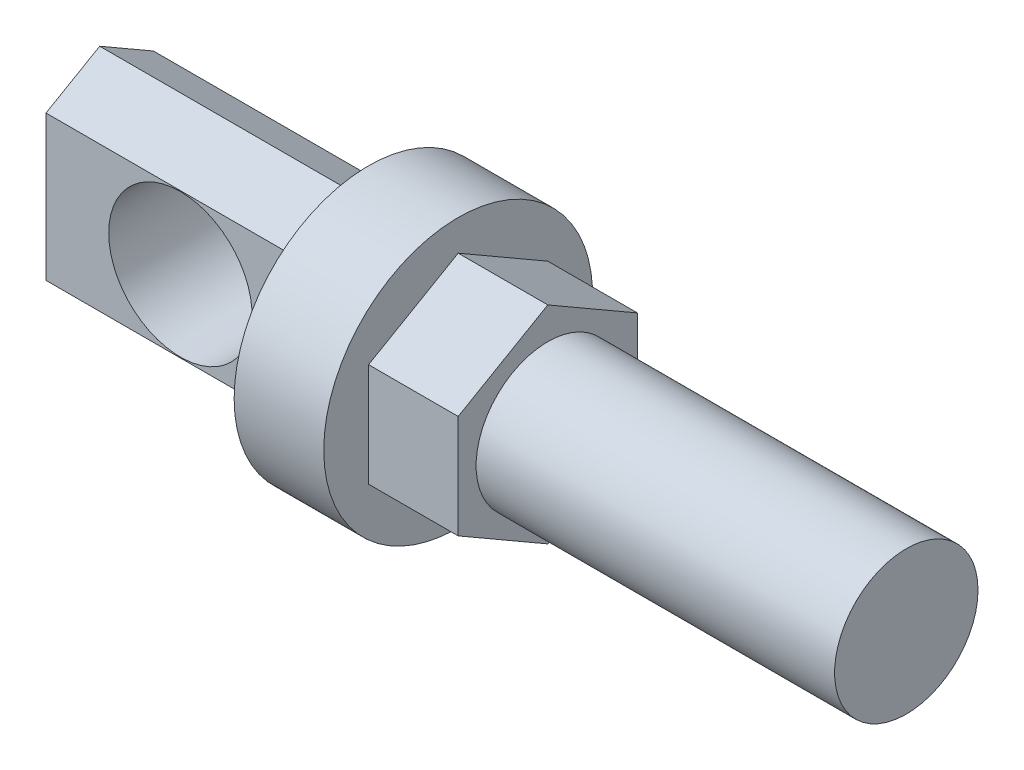
ISO-10303-21;
HEADER;
FILE_DESCRIPTION(('STEP AP214'),'2;1');
FILE_NAME('part.step','',(''),(''),'','','');
FILE_SCHEMA(('AUTOMOTIVE_DESIGN { 1 0 10303 214 1 1 1 1 }'));
ENDSEC;
DATA;
#1=APPLICATION_CONTEXT('core data for automotive mechanical design processes');
#2=APPLICATION_PROTOCOL_DEFINITION('international standard','automotive_design',2000,#1);
#3=PRODUCT_CONTEXT('',#1,'mechanical');
#4=PRODUCT('Part','Part','',(#3));
#5=PRODUCT_RELATED_PRODUCT_CATEGORY('part','',(#4));
#6=PRODUCT_DEFINITION_FORMATION('','',#4);
#7=PRODUCT_DEFINITION_CONTEXT('part definition',#1,'design');
#8=PRODUCT_DEFINITION('design','',#6,#7);
#9=PRODUCT_DEFINITION_SHAPE('','',#8);
#10=(LENGTH_UNIT() NAMED_UNIT(*) SI_UNIT(.MILLI.,.METRE.));
#11=(NAMED_UNIT(*) PLANE_ANGLE_UNIT() SI_UNIT($,.RADIAN.));
#12=(NAMED_UNIT(*) SI_UNIT($,.STERADIAN.) SOLID_ANGLE_UNIT());
#13=UNCERTAINTY_MEASURE_WITH_UNIT(LENGTH_MEASURE(1.E-05),#10,'distance_accuracy_value','');
#14=(GEOMETRIC_REPRESENTATION_CONTEXT(3) GLOBAL_UNCERTAINTY_ASSIGNED_CONTEXT((#13)) GLOBAL_UNIT_ASSIGNED_CONTEXT((#10,
#11,#12)) REPRESENTATION_CONTEXT('',''));
#15=CARTESIAN_POINT('',(0.,0.,0.));
#16=DIRECTION('',(0.,0.,1.));
#17=DIRECTION('',(1.,0.,0.));
#18=AXIS2_PLACEMENT_3D('',#15,#16,#17);
#19=CARTESIAN_POINT('',(-10.,0.,0.));
#20=DIRECTION('',(-1.,0.,0.));
#21=DIRECTION('',(0.,0.,1.));
#22=AXIS2_PLACEMENT_3D('',#19,#20,#21);
#23=PLANE('',#22);
#24=CARTESIAN_POINT('',(-10.,0.,0.));
#25=DIRECTION('',(-1.,0.,0.));
#26=DIRECTION('',(0.,0.,1.));
#27=AXIS2_PLACEMENT_3D('',#24,#25,#26);
#28=CIRCLE('',#27,15.);
#29=CARTESIAN_POINT('',(-10.,0.,15.));
#30=VERTEX_POINT('',#29);
#31=EDGE_CURVE('E216',#30,#30,#28,.T.);
#32=ORIENTED_EDGE('',*,*,#31,.T.);
#33=EDGE_LOOP('',(#32));
#34=FACE_BOUND('',#33,.T.);
#35=DIRECTION('',(0.,-0.5,-0.866025403784439));
#36=VECTOR('',#35,1.);
#37=CARTESIAN_POINT('',(-10.,11.5470053837925,0.));
#38=LINE('',#37,#36);
#39=CARTESIAN_POINT('',(-10.,11.5470053837925,0.));
#40=VERTEX_POINT('',#39);
#41=CARTESIAN_POINT('',(-10.,8.08189421284078,-6.00174860196292));
#42=VERTEX_POINT('',#41);
#43=EDGE_CURVE('E419',#40,#42,#38,.T.);
#44=ORIENTED_EDGE('',*,*,#43,.F.);
#45=DIRECTION('',(0.,0.499999999999999,-0.866025403784439));
#46=VECTOR('',#45,1.);
#47=CARTESIAN_POINT('',(-10.,8.08773356604239,5.99163454553438));
#48=LINE('',#47,#46);
#49=CARTESIAN_POINT('',(-10.,8.08773356604239,5.99163454553438));
#50=VERTEX_POINT('',#49);
#51=EDGE_CURVE('E211',#50,#40,#48,.T.);
#52=ORIENTED_EDGE('',*,*,#51,.F.);
#53=DIRECTION('',(0.,1.,0.));
#54=VECTOR('',#53,1.);
#55=CARTESIAN_POINT('',(-10.,-8.08773356604239,5.99163454553438));
#56=LINE('',#55,#54);
#57=CARTESIAN_POINT('',(-10.,-8.08773356604239,5.99163454553438));
#58=VERTEX_POINT('',#57);
#59=EDGE_CURVE('E207',#58,#50,#56,.T.);
#60=ORIENTED_EDGE('',*,*,#59,.F.);
#61=DIRECTION('',(0.,0.5,0.866025403784439));
#62=VECTOR('',#61,1.);
#63=CARTESIAN_POINT('',(-10.,-11.5470053837925,0.));
#64=LINE('',#63,#62);
#65=CARTESIAN_POINT('',(-10.,-11.5470053837925,0.));
#66=VERTEX_POINT('',#65);
#67=EDGE_CURVE('E435',#66,#58,#64,.T.);
#68=ORIENTED_EDGE('',*,*,#67,.F.);
#69=DIRECTION('',(0.,-0.5,0.866025403784438));
#70=VECTOR('',#69,1.);
#71=CARTESIAN_POINT('',(-10.,-8.08189421284077,-6.00174860196291));
#72=LINE('',#71,#70);
#73=CARTESIAN_POINT('',(-10.,-8.08189421284077,-6.00174860196291));
#74=VERTEX_POINT('',#73);
#75=EDGE_CURVE('E433',#74,#66,#72,.T.);
#76=ORIENTED_EDGE('',*,*,#75,.F.);
#77=DIRECTION('',(0.,-1.,0.));
#78=VECTOR('',#77,1.);
#79=CARTESIAN_POINT('',(-10.,8.08189421284078,-6.00174860196292));
#80=LINE('',#79,#78);
#81=EDGE_CURVE('E431',#42,#74,#80,.T.);
#82=ORIENTED_EDGE('',*,*,#81,.F.);
#83=EDGE_LOOP('',(#44,#52,#60,#68,#76,#82));
#84=FACE_BOUND('',#83,.T.);
#85=ADVANCED_FACE('F34',(#34,#84),#23,.T.);
#86=CARTESIAN_POINT('',(10.,5.77350269189626,-10.));
#87=DIRECTION('',(0.,-0.866025403784439,0.5));
#88=DIRECTION('',(0.,-0.5,-0.866025403784439));
#89=AXIS2_PLACEMENT_3D('',#86,#87,#88);
#90=PLANE('',#89);
#91=DIRECTION('',(0.,0.5,0.866025403784439));
#92=VECTOR('',#91,1.);
#93=CARTESIAN_POINT('',(0.,5.77350269189626,-10.));
#94=LINE('',#93,#92);
#95=CARTESIAN_POINT('',(0.,5.77350269189626,-10.));
#96=VERTEX_POINT('',#95);
#97=CARTESIAN_POINT('',(0.,11.5470053837925,0.));
#98=VERTEX_POINT('',#97);
#99=EDGE_CURVE('E71',#96,#98,#94,.T.);
#100=ORIENTED_EDGE('',*,*,#99,.T.);
#101=DIRECTION('',(-1.,0.,0.));
#102=VECTOR('',#101,1.);
#103=CARTESIAN_POINT('',(10.,11.5470053837925,0.));
#104=LINE('',#103,#102);
#105=CARTESIAN_POINT('',(10.,11.5470053837925,0.));
#106=VERTEX_POINT('',#105);
#107=EDGE_CURVE('E11',#106,#98,#104,.T.);
#108=ORIENTED_EDGE('',*,*,#107,.F.);
#109=DIRECTION('',(0.,0.5,0.866025403784439));
#110=VECTOR('',#109,1.);
#111=CARTESIAN_POINT('',(10.,5.77350269189626,-10.));
#112=LINE('',#111,#110);
#113=CARTESIAN_POINT('',(10.,5.77350269189626,-10.));
#114=VERTEX_POINT('',#113);
#115=EDGE_CURVE('E133',#114,#106,#112,.T.);
#116=ORIENTED_EDGE('',*,*,#115,.F.);
#117=DIRECTION('',(-1.,0.,0.));
#118=VECTOR('',#117,1.);
#119=CARTESIAN_POINT('',(10.,5.77350269189626,-10.));
#120=LINE('',#119,#118);
#121=EDGE_CURVE('E118',#114,#96,#120,.T.);
#122=ORIENTED_EDGE('',*,*,#121,.T.);
#123=EDGE_LOOP('',(#100,#108,#116,#122));
#124=FACE_BOUND('',#123,.T.);
#125=ADVANCED_FACE('F36',(#124),#90,.F.);
#126=CARTESIAN_POINT('',(10.,11.5470053837925,0.));
#127=DIRECTION('',(0.,-0.866025403784439,-0.5));
#128=DIRECTION('',(0.,0.5,-0.866025403784439));
#129=AXIS2_PLACEMENT_3D('',#126,#127,#128);
#130=PLANE('',#129);
#131=DIRECTION('',(0.,-0.5,0.866025403784438));
#132=VECTOR('',#131,1.);
#133=CARTESIAN_POINT('',(0.,11.5470053837925,0.));
#134=LINE('',#133,#132);
#135=CARTESIAN_POINT('',(0.,5.77350269189626,10.));
#136=VERTEX_POINT('',#135);
#137=EDGE_CURVE('E80',#98,#136,#134,.T.);
#138=ORIENTED_EDGE('',*,*,#137,.T.);
#139=DIRECTION('',(-1.,0.,0.));
#140=VECTOR('',#139,1.);
#141=CARTESIAN_POINT('',(10.,5.77350269189626,10.));
#142=LINE('',#141,#140);
#143=CARTESIAN_POINT('',(10.,5.77350269189626,10.));
#144=VERTEX_POINT('',#143);
#145=EDGE_CURVE('E42',#144,#136,#142,.T.);
#146=ORIENTED_EDGE('',*,*,#145,.F.);
#147=DIRECTION('',(0.,-0.5,0.866025403784438));
#148=VECTOR('',#147,1.);
#149=CARTESIAN_POINT('',(10.,11.5470053837925,0.));
#150=LINE('',#149,#148);
#151=EDGE_CURVE('E143',#106,#144,#150,.T.);
#152=ORIENTED_EDGE('',*,*,#151,.F.);
#153=ORIENTED_EDGE('',*,*,#107,.T.);
#154=EDGE_LOOP('',(#138,#146,#152,#153));
#155=FACE_BOUND('',#154,.T.);
#156=ADVANCED_FACE('F142',(#155),#130,.F.);
#157=CARTESIAN_POINT('',(10.,5.77350269189626,10.));
#158=DIRECTION('',(0.,0.,-1.));
#159=DIRECTION('',(-1.,0.,0.));
#160=AXIS2_PLACEMENT_3D('',#157,#158,#159);
#161=PLANE('',#160);
#162=DIRECTION('',(0.,-1.,0.));
#163=VECTOR('',#162,1.);
#164=CARTESIAN_POINT('',(0.,5.77350269189626,10.));
#165=LINE('',#164,#163);
#166=CARTESIAN_POINT('',(0.,-5.77350269189626,10.));
#167=VERTEX_POINT('',#166);
#168=EDGE_CURVE('E125',#136,#167,#165,.T.);
#169=ORIENTED_EDGE('',*,*,#168,.T.);
#170=DIRECTION('',(-1.,0.,0.));
#171=VECTOR('',#170,1.);
#172=CARTESIAN_POINT('',(10.,-5.77350269189626,10.));
#173=LINE('',#172,#171);
#174=CARTESIAN_POINT('',(10.,-5.77350269189626,10.));
#175=VERTEX_POINT('',#174);
#176=EDGE_CURVE('E112',#175,#167,#173,.T.);
#177=ORIENTED_EDGE('',*,*,#176,.F.);
#178=DIRECTION('',(0.,-1.,0.));
#179=VECTOR('',#178,1.);
#180=CARTESIAN_POINT('',(10.,5.77350269189626,10.));
#181=LINE('',#180,#179);
#182=EDGE_CURVE('E98',#144,#175,#181,.T.);
#183=ORIENTED_EDGE('',*,*,#182,.F.);
#184=ORIENTED_EDGE('',*,*,#145,.T.);
#185=EDGE_LOOP('',(#169,#177,#183,#184));
#186=FACE_BOUND('',#185,.T.);
#187=ADVANCED_FACE('F140',(#186),#161,.F.);
#188=CARTESIAN_POINT('',(10.,-5.77350269189626,10.));
#189=DIRECTION('',(0.,0.866025403784438,-0.5));
#190=DIRECTION('',(0.,0.5,0.866025403784439));
#191=AXIS2_PLACEMENT_3D('',#188,#189,#190);
#192=PLANE('',#191);
#193=DIRECTION('',(0.,-0.5,-0.866025403784438));
#194=VECTOR('',#193,1.);
#195=CARTESIAN_POINT('',(0.,-5.77350269189626,10.));
#196=LINE('',#195,#194);
#197=CARTESIAN_POINT('',(0.,-11.5470053837925,0.));
#198=VERTEX_POINT('',#197);
#199=EDGE_CURVE('E109',#167,#198,#196,.T.);
#200=ORIENTED_EDGE('',*,*,#199,.T.);
#201=DIRECTION('',(-1.,0.,0.));
#202=VECTOR('',#201,1.);
#203=CARTESIAN_POINT('',(10.,-11.5470053837925,0.));
#204=LINE('',#203,#202);
#205=CARTESIAN_POINT('',(10.,-11.5470053837925,0.));
#206=VERTEX_POINT('',#205);
#207=EDGE_CURVE('E105',#206,#198,#204,.T.);
#208=ORIENTED_EDGE('',*,*,#207,.F.);
#209=DIRECTION('',(0.,-0.5,-0.866025403784438));
#210=VECTOR('',#209,1.);
#211=CARTESIAN_POINT('',(10.,-5.77350269189626,10.));
#212=LINE('',#211,#210);
#213=EDGE_CURVE('E91',#175,#206,#212,.T.);
#214=ORIENTED_EDGE('',*,*,#213,.F.);
#215=ORIENTED_EDGE('',*,*,#176,.T.);
#216=EDGE_LOOP('',(#200,#208,#214,#215));
#217=FACE_BOUND('',#216,.T.);
#218=ADVANCED_FACE('F106',(#217),#192,.F.);
#219=CARTESIAN_POINT('',(10.,-11.5470053837925,0.));
#220=DIRECTION('',(0.,0.866025403784439,0.5));
#221=DIRECTION('',(0.,-0.5,0.866025403784439));
#222=AXIS2_PLACEMENT_3D('',#219,#220,#221);
#223=PLANE('',#222);
#224=DIRECTION('',(0.,0.5,-0.866025403784438));
#225=VECTOR('',#224,1.);
#226=CARTESIAN_POINT('',(0.,-11.5470053837925,0.));
#227=LINE('',#226,#225);
#228=CARTESIAN_POINT('',(0.,-5.77350269189626,-10.));
#229=VERTEX_POINT('',#228);
#230=EDGE_CURVE('E129',#198,#229,#227,.T.);
#231=ORIENTED_EDGE('',*,*,#230,.T.);
#232=DIRECTION('',(-1.,0.,0.));
#233=VECTOR('',#232,1.);
#234=CARTESIAN_POINT('',(10.,-5.77350269189626,-10.));
#235=LINE('',#234,#233);
#236=CARTESIAN_POINT('',(10.,-5.77350269189626,-10.));
#237=VERTEX_POINT('',#236);
#238=EDGE_CURVE('E113',#237,#229,#235,.T.);
#239=ORIENTED_EDGE('',*,*,#238,.F.);
#240=DIRECTION('',(0.,0.5,-0.866025403784438));
#241=VECTOR('',#240,1.);
#242=CARTESIAN_POINT('',(10.,-11.5470053837925,0.));
#243=LINE('',#242,#241);
#244=EDGE_CURVE('E95',#206,#237,#243,.T.);
#245=ORIENTED_EDGE('',*,*,#244,.F.);
#246=ORIENTED_EDGE('',*,*,#207,.T.);
#247=EDGE_LOOP('',(#231,#239,#245,#246));
#248=FACE_BOUND('',#247,.T.);
#249=ADVANCED_FACE('F115',(#248),#223,.F.);
#250=CARTESIAN_POINT('',(10.,-5.77350269189626,-10.));
#251=DIRECTION('',(0.,0.,1.));
#252=DIRECTION('',(1.,0.,0.));
#253=AXIS2_PLACEMENT_3D('',#250,#251,#252);
#254=PLANE('',#253);
#255=DIRECTION('',(0.,1.,0.));
#256=VECTOR('',#255,1.);
#257=CARTESIAN_POINT('',(0.,-5.77350269189626,-10.));
#258=LINE('',#257,#256);
#259=EDGE_CURVE('E131',#229,#96,#258,.T.);
#260=ORIENTED_EDGE('',*,*,#259,.T.);
#261=ORIENTED_EDGE('',*,*,#121,.F.);
#262=DIRECTION('',(0.,1.,0.));
#263=VECTOR('',#262,1.);
#264=CARTESIAN_POINT('',(10.,-5.77350269189626,-10.));
#265=LINE('',#264,#263);
#266=EDGE_CURVE('E58',#237,#114,#265,.T.);
#267=ORIENTED_EDGE('',*,*,#266,.F.);
#268=ORIENTED_EDGE('',*,*,#238,.T.);
#269=EDGE_LOOP('',(#260,#261,#267,#268));
#270=FACE_BOUND('',#269,.T.);
#271=ADVANCED_FACE('F148',(#270),#254,.F.);
#272=CARTESIAN_POINT('',(10.,0.,0.));
#273=DIRECTION('',(1.,0.,0.));
#274=DIRECTION('',(0.,0.,-1.));
#275=AXIS2_PLACEMENT_3D('',#272,#273,#274);
#276=PLANE('',#275);
#277=CARTESIAN_POINT('',(10.,0.,0.));
#278=DIRECTION('',(1.,0.,0.));
#279=DIRECTION('',(0.,0.,-1.));
#280=AXIS2_PLACEMENT_3D('',#277,#278,#279);
#281=CIRCLE('',#280,8.);
#282=CARTESIAN_POINT('',(10.,0.,-8.));
#283=VERTEX_POINT('',#282);
#284=EDGE_CURVE('E223',#283,#283,#281,.T.);
#285=ORIENTED_EDGE('',*,*,#284,.F.);
#286=EDGE_LOOP('',(#285));
#287=FACE_BOUND('',#286,.T.);
#288=ORIENTED_EDGE('',*,*,#115,.T.);
#289=ORIENTED_EDGE('',*,*,#151,.T.);
#290=ORIENTED_EDGE('',*,*,#182,.T.);
#291=ORIENTED_EDGE('',*,*,#213,.T.);
#292=ORIENTED_EDGE('',*,*,#244,.T.);
#293=ORIENTED_EDGE('',*,*,#266,.T.);
#294=EDGE_LOOP('',(#288,#289,#290,#291,#292,#293));
#295=FACE_BOUND('',#294,.T.);
#296=ADVANCED_FACE('F93',(#287,#295),#276,.T.);
#297=CARTESIAN_POINT('',(50.,0.,0.));
#298=DIRECTION('',(-1.,0.,0.));
#299=DIRECTION('',(0.,0.,1.));
#300=AXIS2_PLACEMENT_3D('',#297,#298,#299);
#301=CYLINDRICAL_SURFACE('',#300,8.);
#302=CARTESIAN_POINT('',(50.,0.,0.));
#303=DIRECTION('',(1.,0.,0.));
#304=DIRECTION('',(0.,0.,-1.));
#305=AXIS2_PLACEMENT_3D('',#302,#303,#304);
#306=CIRCLE('',#305,8.);
#307=CARTESIAN_POINT('',(50.,0.,-8.));
#308=VERTEX_POINT('',#307);
#309=EDGE_CURVE('E123',#308,#308,#306,.T.);
#310=ORIENTED_EDGE('',*,*,#309,.F.);
#311=EDGE_LOOP('',(#310));
#312=FACE_BOUND('',#311,.T.);
#313=ORIENTED_EDGE('',*,*,#284,.T.);
#314=EDGE_LOOP('',(#313));
#315=FACE_BOUND('',#314,.T.);
#316=ADVANCED_FACE('F232',(#312,#315),#301,.T.);
#317=CARTESIAN_POINT('',(50.,0.,0.));
#318=DIRECTION('',(1.,0.,0.));
#319=DIRECTION('',(0.,0.,-1.));
#320=AXIS2_PLACEMENT_3D('',#317,#318,#319);
#321=PLANE('',#320);
#322=ORIENTED_EDGE('',*,*,#309,.T.);
#323=EDGE_LOOP('',(#322));
#324=FACE_BOUND('',#323,.T.);
#325=ADVANCED_FACE('F240',(#324),#321,.T.);
#326=CARTESIAN_POINT('',(0.,0.,0.));
#327=DIRECTION('',(-1.,0.,0.));
#328=DIRECTION('',(0.,0.,1.));
#329=AXIS2_PLACEMENT_3D('',#326,#327,#328);
#330=PLANE('',#329);
#331=CARTESIAN_POINT('',(0.,0.,0.));
#332=DIRECTION('',(-1.,0.,0.));
#333=DIRECTION('',(0.,0.,1.));
#334=AXIS2_PLACEMENT_3D('',#331,#332,#333);
#335=CIRCLE('',#334,15.);
#336=CARTESIAN_POINT('',(0.,0.,15.));
#337=VERTEX_POINT('',#336);
#338=EDGE_CURVE('E213',#337,#337,#335,.T.);
#339=ORIENTED_EDGE('',*,*,#338,.F.);
#340=EDGE_LOOP('',(#339));
#341=FACE_BOUND('',#340,.T.);
#342=ORIENTED_EDGE('',*,*,#137,.F.);
#343=ORIENTED_EDGE('',*,*,#99,.F.);
#344=ORIENTED_EDGE('',*,*,#259,.F.);
#345=ORIENTED_EDGE('',*,*,#230,.F.);
#346=ORIENTED_EDGE('',*,*,#199,.F.);
#347=ORIENTED_EDGE('',*,*,#168,.F.);
#348=EDGE_LOOP('',(#342,#343,#344,#345,#346,#347));
#349=FACE_BOUND('',#348,.T.);
#350=ADVANCED_FACE('F151',(#341,#349),#330,.F.);
#351=CARTESIAN_POINT('',(-10.,0.,0.));
#352=DIRECTION('',(1.,0.,0.));
#353=DIRECTION('',(0.,0.,-1.));
#354=AXIS2_PLACEMENT_3D('',#351,#352,#353);
#355=CYLINDRICAL_SURFACE('',#354,15.);
#356=ORIENTED_EDGE('',*,*,#31,.F.);
#357=EDGE_LOOP('',(#356));
#358=FACE_BOUND('',#357,.T.);
#359=ORIENTED_EDGE('',*,*,#338,.T.);
#360=EDGE_LOOP('',(#359));
#361=FACE_BOUND('',#360,.T.);
#362=ADVANCED_FACE('F256',(#358,#361),#355,.T.);
#363=CARTESIAN_POINT('',(-40.,8.08773356604239,5.99163454553438));
#364=DIRECTION('',(0.,-0.866025403784439,-0.499999999999999));
#365=DIRECTION('',(0.,0.5,-0.866025403784439));
#366=AXIS2_PLACEMENT_3D('',#363,#364,#365);
#367=PLANE('',#366);
#368=ORIENTED_EDGE('',*,*,#51,.T.);
#369=DIRECTION('',(1.,0.,0.));
#370=VECTOR('',#369,1.);
#371=CARTESIAN_POINT('',(-40.,11.5470053837925,0.));
#372=LINE('',#371,#370);
#373=CARTESIAN_POINT('',(-40.,11.5470053837925,0.));
#374=VERTEX_POINT('',#373);
#375=EDGE_CURVE('E192',#374,#40,#372,.T.);
#376=ORIENTED_EDGE('',*,*,#375,.F.);
#377=DIRECTION('',(0.,0.499999999999999,-0.866025403784439));
#378=VECTOR('',#377,1.);
#379=CARTESIAN_POINT('',(-40.,8.08773356604239,5.99163454553438));
#380=LINE('',#379,#378);
#381=CARTESIAN_POINT('',(-40.,8.08773356604239,5.99163454553438));
#382=VERTEX_POINT('',#381);
#383=EDGE_CURVE('E199',#382,#374,#380,.T.);
#384=ORIENTED_EDGE('',*,*,#383,.F.);
#385=DIRECTION('',(1.,0.,0.));
#386=VECTOR('',#385,1.);
#387=CARTESIAN_POINT('',(-40.,8.08773356604239,5.99163454553438));
#388=LINE('',#387,#386);
#389=EDGE_CURVE('E428',#382,#50,#388,.T.);
#390=ORIENTED_EDGE('',*,*,#389,.T.);
#391=EDGE_LOOP('',(#368,#376,#384,#390));
#392=FACE_BOUND('',#391,.T.);
#393=ADVANCED_FACE('F209',(#392),#367,.F.);
#394=CARTESIAN_POINT('',(-40.,11.5470053837925,0.));
#395=DIRECTION('',(0.,-0.866025403784439,0.5));
#396=DIRECTION('',(0.,-0.5,-0.866025403784439));
#397=AXIS2_PLACEMENT_3D('',#394,#395,#396);
#398=PLANE('',#397);
#399=ORIENTED_EDGE('',*,*,#43,.T.);
#400=DIRECTION('',(1.,0.,0.));
#401=VECTOR('',#400,1.);
#402=CARTESIAN_POINT('',(-40.,8.08189421284078,-6.00174860196292));
#403=LINE('',#402,#401);
#404=CARTESIAN_POINT('',(-40.,8.08189421284078,-6.00174860196292));
#405=VERTEX_POINT('',#404);
#406=EDGE_CURVE('E195',#405,#42,#403,.T.);
#407=ORIENTED_EDGE('',*,*,#406,.F.);
#408=DIRECTION('',(0.,-0.5,-0.866025403784439));
#409=VECTOR('',#408,1.);
#410=CARTESIAN_POINT('',(-40.,11.5470053837925,0.));
#411=LINE('',#410,#409);
#412=EDGE_CURVE('E188',#374,#405,#411,.T.);
#413=ORIENTED_EDGE('',*,*,#412,.F.);
#414=ORIENTED_EDGE('',*,*,#375,.T.);
#415=EDGE_LOOP('',(#399,#407,#413,#414));
#416=FACE_BOUND('',#415,.T.);
#417=ADVANCED_FACE('F190',(#416),#398,.F.);
#418=CARTESIAN_POINT('',(-40.,8.08189421284078,-6.00174860196292));
#419=DIRECTION('',(0.,0.,1.));
#420=DIRECTION('',(0.,-1.,0.));
#421=AXIS2_PLACEMENT_3D('',#418,#419,#420);
#422=PLANE('',#421);
#423=CARTESIAN_POINT('',(-25.,0.,-6.00174860196291));
#424=DIRECTION('',(0.,0.,-1.));
#425=DIRECTION('',(0.,1.,0.));
#426=AXIS2_PLACEMENT_3D('',#423,#424,#425);
#427=CIRCLE('',#426,8.);
#428=CARTESIAN_POINT('',(-25.,8.,-6.00174860196292));
#429=VERTEX_POINT('',#428);
#430=EDGE_CURVE('E414',#429,#429,#427,.T.);
#431=ORIENTED_EDGE('',*,*,#430,.F.);
#432=EDGE_LOOP('',(#431));
#433=FACE_BOUND('',#432,.T.);
#434=ORIENTED_EDGE('',*,*,#81,.T.);
#435=DIRECTION('',(1.,0.,0.));
#436=VECTOR('',#435,1.);
#437=CARTESIAN_POINT('',(-40.,-8.08189421284077,-6.00174860196291));
#438=LINE('',#437,#436);
#439=CARTESIAN_POINT('',(-40.,-8.08189421284077,-6.00174860196291));
#440=VERTEX_POINT('',#439);
#441=EDGE_CURVE('E218',#440,#74,#438,.T.);
#442=ORIENTED_EDGE('',*,*,#441,.F.);
#443=DIRECTION('',(0.,-1.,0.));
#444=VECTOR('',#443,1.);
#445=CARTESIAN_POINT('',(-40.,8.08189421284078,-6.00174860196292));
#446=LINE('',#445,#444);
#447=EDGE_CURVE('E198',#405,#440,#446,.T.);
#448=ORIENTED_EDGE('',*,*,#447,.F.);
#449=ORIENTED_EDGE('',*,*,#406,.T.);
#450=EDGE_LOOP('',(#434,#442,#448,#449));
#451=FACE_BOUND('',#450,.T.);
#452=ADVANCED_FACE('F289',(#433,#451),#422,.F.);
#453=CARTESIAN_POINT('',(-40.,-8.08189421284077,-6.00174860196291));
#454=DIRECTION('',(0.,0.866025403784438,0.5));
#455=DIRECTION('',(0.,-0.5,0.866025403784438));
#456=AXIS2_PLACEMENT_3D('',#453,#454,#455);
#457=PLANE('',#456);
#458=ORIENTED_EDGE('',*,*,#75,.T.);
#459=DIRECTION('',(1.,0.,0.));
#460=VECTOR('',#459,1.);
#461=CARTESIAN_POINT('',(-40.,-11.5470053837925,0.));
#462=LINE('',#461,#460);
#463=CARTESIAN_POINT('',(-40.,-11.5470053837925,0.));
#464=VERTEX_POINT('',#463);
#465=EDGE_CURVE('E440',#464,#66,#462,.T.);
#466=ORIENTED_EDGE('',*,*,#465,.F.);
#467=DIRECTION('',(0.,-0.5,0.866025403784438));
#468=VECTOR('',#467,1.);
#469=CARTESIAN_POINT('',(-40.,-8.08189421284077,-6.00174860196291));
#470=LINE('',#469,#468);
#471=EDGE_CURVE('E424',#440,#464,#470,.T.);
#472=ORIENTED_EDGE('',*,*,#471,.F.);
#473=ORIENTED_EDGE('',*,*,#441,.T.);
#474=EDGE_LOOP('',(#458,#466,#472,#473));
#475=FACE_BOUND('',#474,.T.);
#476=ADVANCED_FACE('F296',(#475),#457,.F.);
#477=CARTESIAN_POINT('',(-40.,-11.5470053837925,0.));
#478=DIRECTION('',(0.,0.866025403784439,-0.5));
#479=DIRECTION('',(0.,0.5,0.866025403784439));
#480=AXIS2_PLACEMENT_3D('',#477,#478,#479);
#481=PLANE('',#480);
#482=ORIENTED_EDGE('',*,*,#67,.T.);
#483=DIRECTION('',(1.,0.,0.));
#484=VECTOR('',#483,1.);
#485=CARTESIAN_POINT('',(-40.,-8.08773356604239,5.99163454553438));
#486=LINE('',#485,#484);
#487=CARTESIAN_POINT('',(-40.,-8.08773356604239,5.99163454553438));
#488=VERTEX_POINT('',#487);
#489=EDGE_CURVE('E49',#488,#58,#486,.T.);
#490=ORIENTED_EDGE('',*,*,#489,.F.);
#491=DIRECTION('',(0.,0.5,0.866025403784439));
#492=VECTOR('',#491,1.);
#493=CARTESIAN_POINT('',(-40.,-11.5470053837925,0.));
#494=LINE('',#493,#492);
#495=EDGE_CURVE('E426',#464,#488,#494,.T.);
#496=ORIENTED_EDGE('',*,*,#495,.F.);
#497=ORIENTED_EDGE('',*,*,#465,.T.);
#498=EDGE_LOOP('',(#482,#490,#496,#497));
#499=FACE_BOUND('',#498,.T.);
#500=ADVANCED_FACE('F305',(#499),#481,.F.);
#501=CARTESIAN_POINT('',(-40.,-8.08773356604239,5.99163454553438));
#502=DIRECTION('',(0.,0.,-1.));
#503=DIRECTION('',(-1.,0.,0.));
#504=AXIS2_PLACEMENT_3D('',#501,#502,#503);
#505=PLANE('',#504);
#506=CARTESIAN_POINT('',(-25.,0.,5.99163454553438));
#507=DIRECTION('',(0.,0.,-1.));
#508=DIRECTION('',(-1.,0.,0.));
#509=AXIS2_PLACEMENT_3D('',#506,#507,#508);
#510=CIRCLE('',#509,8.);
#511=CARTESIAN_POINT('',(-33.,0.,5.99163454553438));
#512=VERTEX_POINT('',#511);
#513=EDGE_CURVE('E417',#512,#512,#510,.F.);
#514=ORIENTED_EDGE('',*,*,#513,.F.);
#515=EDGE_LOOP('',(#514));
#516=FACE_BOUND('',#515,.T.);
#517=ORIENTED_EDGE('',*,*,#59,.T.);
#518=ORIENTED_EDGE('',*,*,#389,.F.);
#519=DIRECTION('',(0.,1.,0.));
#520=VECTOR('',#519,1.);
#521=CARTESIAN_POINT('',(-40.,-8.08773356604239,5.99163454553438));
#522=LINE('',#521,#520);
#523=EDGE_CURVE('E203',#488,#382,#522,.T.);
#524=ORIENTED_EDGE('',*,*,#523,.F.);
#525=ORIENTED_EDGE('',*,*,#489,.T.);
#526=EDGE_LOOP('',(#517,#518,#524,#525));
#527=FACE_BOUND('',#526,.T.);
#528=ADVANCED_FACE('F313',(#516,#527),#505,.F.);
#529=CARTESIAN_POINT('',(-40.,0.,0.));
#530=DIRECTION('',(-1.,0.,0.));
#531=DIRECTION('',(0.,0.,1.));
#532=AXIS2_PLACEMENT_3D('',#529,#530,#531);
#533=PLANE('',#532);
#534=ORIENTED_EDGE('',*,*,#383,.T.);
#535=ORIENTED_EDGE('',*,*,#412,.T.);
#536=ORIENTED_EDGE('',*,*,#447,.T.);
#537=ORIENTED_EDGE('',*,*,#471,.T.);
#538=ORIENTED_EDGE('',*,*,#495,.T.);
#539=ORIENTED_EDGE('',*,*,#523,.T.);
#540=EDGE_LOOP('',(#534,#535,#536,#537,#538,#539));
#541=FACE_BOUND('',#540,.T.);
#542=ADVANCED_FACE('F202',(#541),#533,.T.);
#543=CARTESIAN_POINT('',(-25.,0.,15.001));
#544=DIRECTION('',(0.,0.,-1.));
#545=DIRECTION('',(0.,1.,0.));
#546=AXIS2_PLACEMENT_3D('',#543,#544,#545);
#547=CYLINDRICAL_SURFACE('',#546,8.);
#548=ORIENTED_EDGE('',*,*,#430,.T.);
#549=EDGE_LOOP('',(#548));
#550=FACE_BOUND('',#549,.T.);
#551=ORIENTED_EDGE('',*,*,#513,.T.);
#552=EDGE_LOOP('',(#551));
#553=FACE_BOUND('',#552,.T.);
#554=ADVANCED_FACE('F327',(#550,#553),#547,.F.);
#555=CLOSED_SHELL('',(#85,#125,#156,#187,#218,#249,#271,#296,#316,#325,#350,#362,#393,#417,#452,
#476,#500,#528,#542,#554));
#556=MANIFOLD_SOLID_BREP('B2',#555);
#557=ADVANCED_BREP_SHAPE_REPRESENTATION('',(#18,#556),#14);
#558=SHAPE_DEFINITION_REPRESENTATION(#9,#557);
ENDSEC;
END-ISO-10303-21;
